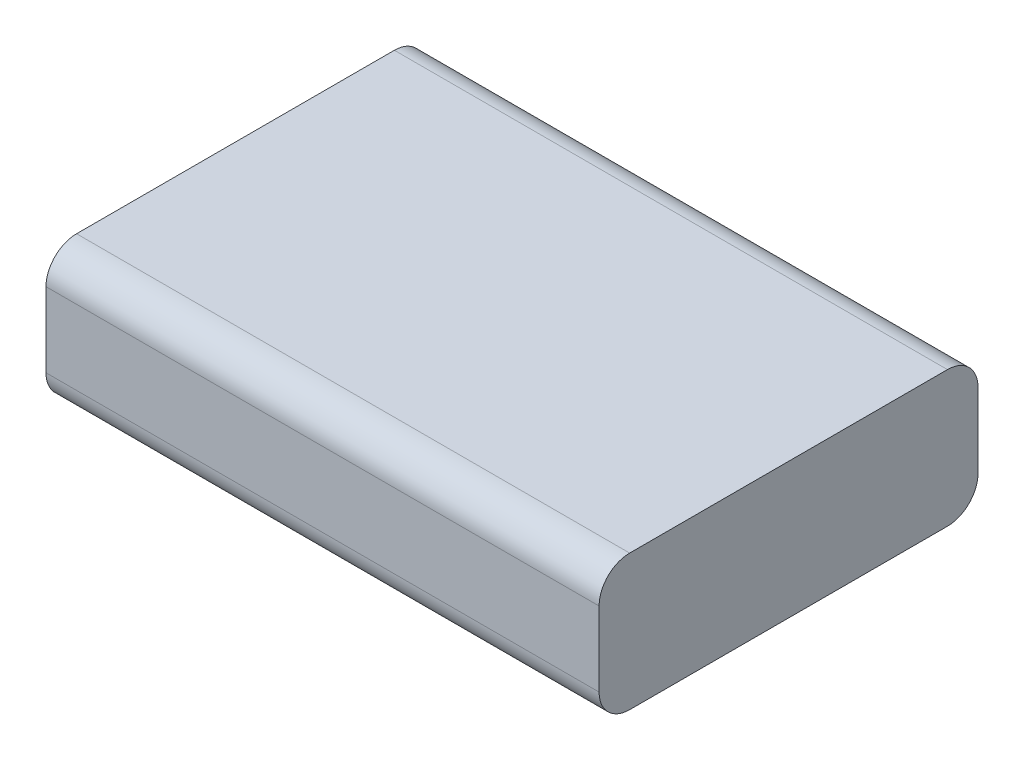
ISO-10303-21;
HEADER;
FILE_DESCRIPTION(('STEP AP214'),'2;1');
FILE_NAME('part.step','',(''),(''),'','','');
FILE_SCHEMA(('AUTOMOTIVE_DESIGN { 1 0 10303 214 1 1 1 1 }'));
ENDSEC;
DATA;
#1=APPLICATION_CONTEXT('core data for automotive mechanical design processes');
#2=APPLICATION_PROTOCOL_DEFINITION('international standard','automotive_design',2000,#1);
#3=PRODUCT_CONTEXT('',#1,'mechanical');
#4=PRODUCT('Part','Part','',(#3));
#5=PRODUCT_RELATED_PRODUCT_CATEGORY('part','',(#4));
#6=PRODUCT_DEFINITION_FORMATION('','',#4);
#7=PRODUCT_DEFINITION_CONTEXT('part definition',#1,'design');
#8=PRODUCT_DEFINITION('design','',#6,#7);
#9=PRODUCT_DEFINITION_SHAPE('','',#8);
#10=(LENGTH_UNIT() NAMED_UNIT(*) SI_UNIT(.MILLI.,.METRE.));
#11=(NAMED_UNIT(*) PLANE_ANGLE_UNIT() SI_UNIT($,.RADIAN.));
#12=(NAMED_UNIT(*) SI_UNIT($,.STERADIAN.) SOLID_ANGLE_UNIT());
#13=UNCERTAINTY_MEASURE_WITH_UNIT(LENGTH_MEASURE(1.E-05),#10,'distance_accuracy_value','');
#14=(GEOMETRIC_REPRESENTATION_CONTEXT(3) GLOBAL_UNCERTAINTY_ASSIGNED_CONTEXT((#13)) GLOBAL_UNIT_ASSIGNED_CONTEXT((#10,
#11,#12)) REPRESENTATION_CONTEXT('',''));
#15=CARTESIAN_POINT('',(0.,0.,0.));
#16=DIRECTION('',(0.,0.,1.));
#17=DIRECTION('',(1.,0.,0.));
#18=AXIS2_PLACEMENT_3D('',#15,#16,#17);
#19=CARTESIAN_POINT('',(0.,22.2,0.));
#20=DIRECTION('',(1.,0.,0.));
#21=DIRECTION('',(0.,0.,-1.));
#22=AXIS2_PLACEMENT_3D('',#19,#20,#21);
#23=PLANE('',#22);
#24=DIRECTION('',(0.,-1.,0.));
#25=VECTOR('',#24,1.);
#26=CARTESIAN_POINT('',(0.,22.2,-62.));
#27=LINE('',#26,#25);
#28=CARTESIAN_POINT('',(0.,17.2,-62.));
#29=VERTEX_POINT('',#28);
#30=CARTESIAN_POINT('',(0.,5.,-62.));
#31=VERTEX_POINT('',#30);
#32=EDGE_CURVE('E106',#29,#31,#27,.T.);
#33=ORIENTED_EDGE('',*,*,#32,.T.);
#34=CARTESIAN_POINT('',(0.,5.,-57.));
#35=DIRECTION('',(1.,0.,0.));
#36=DIRECTION('',(0.,0.,-1.));
#37=AXIS2_PLACEMENT_3D('',#34,#35,#36);
#38=CIRCLE('',#37,5.);
#39=CARTESIAN_POINT('',(0.,0.,-57.));
#40=VERTEX_POINT('',#39);
#41=EDGE_CURVE('E113',#31,#40,#38,.F.);
#42=ORIENTED_EDGE('',*,*,#41,.T.);
#43=DIRECTION('',(0.,0.,1.));
#44=VECTOR('',#43,1.);
#45=CARTESIAN_POINT('',(0.,0.,0.));
#46=LINE('',#45,#44);
#47=CARTESIAN_POINT('',(0.,0.,-5.));
#48=VERTEX_POINT('',#47);
#49=EDGE_CURVE('E173',#40,#48,#46,.T.);
#50=ORIENTED_EDGE('',*,*,#49,.T.);
#51=CARTESIAN_POINT('',(0.,5.,-5.));
#52=DIRECTION('',(1.,0.,0.));
#53=DIRECTION('',(0.,0.,-1.));
#54=AXIS2_PLACEMENT_3D('',#51,#52,#53);
#55=CIRCLE('',#54,5.);
#56=CARTESIAN_POINT('',(0.,5.,0.));
#57=VERTEX_POINT('',#56);
#58=EDGE_CURVE('E114',#48,#57,#55,.F.);
#59=ORIENTED_EDGE('',*,*,#58,.T.);
#60=DIRECTION('',(0.,-1.,0.));
#61=VECTOR('',#60,1.);
#62=CARTESIAN_POINT('',(0.,22.2,0.));
#63=LINE('',#62,#61);
#64=CARTESIAN_POINT('',(0.,17.2,0.));
#65=VERTEX_POINT('',#64);
#66=EDGE_CURVE('E130',#65,#57,#63,.T.);
#67=ORIENTED_EDGE('',*,*,#66,.F.);
#68=CARTESIAN_POINT('',(0.,17.2,-5.));
#69=DIRECTION('',(1.,0.,0.));
#70=DIRECTION('',(0.,0.,-1.));
#71=AXIS2_PLACEMENT_3D('',#68,#69,#70);
#72=CIRCLE('',#71,5.);
#73=CARTESIAN_POINT('',(0.,22.2,-5.));
#74=VERTEX_POINT('',#73);
#75=EDGE_CURVE('E132',#65,#74,#72,.F.);
#76=ORIENTED_EDGE('',*,*,#75,.T.);
#77=DIRECTION('',(0.,0.,1.));
#78=VECTOR('',#77,1.);
#79=CARTESIAN_POINT('',(0.,22.2,0.));
#80=LINE('',#79,#78);
#81=CARTESIAN_POINT('',(0.,22.2,-57.));
#82=VERTEX_POINT('',#81);
#83=EDGE_CURVE('E108',#82,#74,#80,.T.);
#84=ORIENTED_EDGE('',*,*,#83,.F.);
#85=CARTESIAN_POINT('',(0.,17.2,-57.));
#86=DIRECTION('',(1.,0.,0.));
#87=DIRECTION('',(0.,0.,-1.));
#88=AXIS2_PLACEMENT_3D('',#85,#86,#87);
#89=CIRCLE('',#88,5.);
#90=EDGE_CURVE('E104',#82,#29,#89,.F.);
#91=ORIENTED_EDGE('',*,*,#90,.T.);
#92=EDGE_LOOP('',(#33,#42,#50,#59,#67,#76,#84,#91));
#93=FACE_BOUND('',#92,.T.);
#94=ADVANCED_FACE('F38',(#93),#23,.F.);
#95=CARTESIAN_POINT('',(0.,22.2,0.));
#96=DIRECTION('',(0.,0.,-1.));
#97=DIRECTION('',(-1.,0.,0.));
#98=AXIS2_PLACEMENT_3D('',#95,#96,#97);
#99=PLANE('',#98);
#100=ORIENTED_EDGE('',*,*,#66,.T.);
#101=DIRECTION('',(1.,0.,0.));
#102=VECTOR('',#101,1.);
#103=CARTESIAN_POINT('',(90.5,5.,0.));
#104=LINE('',#103,#102);
#105=CARTESIAN_POINT('',(90.5,5.,0.));
#106=VERTEX_POINT('',#105);
#107=EDGE_CURVE('E11',#57,#106,#104,.T.);
#108=ORIENTED_EDGE('',*,*,#107,.T.);
#109=DIRECTION('',(0.,-1.,0.));
#110=VECTOR('',#109,1.);
#111=CARTESIAN_POINT('',(90.5,22.2,0.));
#112=LINE('',#111,#110);
#113=CARTESIAN_POINT('',(90.5,17.2,0.));
#114=VERTEX_POINT('',#113);
#115=EDGE_CURVE('E135',#114,#106,#112,.T.);
#116=ORIENTED_EDGE('',*,*,#115,.F.);
#117=DIRECTION('',(1.,0.,0.));
#118=VECTOR('',#117,1.);
#119=CARTESIAN_POINT('',(0.,17.2,0.));
#120=LINE('',#119,#118);
#121=EDGE_CURVE('E46',#114,#65,#120,.F.);
#122=ORIENTED_EDGE('',*,*,#121,.T.);
#123=EDGE_LOOP('',(#100,#108,#116,#122));
#124=FACE_BOUND('',#123,.T.);
#125=ADVANCED_FACE('F158',(#124),#99,.F.);
#126=CARTESIAN_POINT('',(90.5,22.2,0.));
#127=DIRECTION('',(-1.,0.,0.));
#128=DIRECTION('',(0.,0.,1.));
#129=AXIS2_PLACEMENT_3D('',#126,#127,#128);
#130=PLANE('',#129);
#131=DIRECTION('',(0.,0.,-1.));
#132=VECTOR('',#131,1.);
#133=CARTESIAN_POINT('',(90.5,0.,0.));
#134=LINE('',#133,#132);
#135=CARTESIAN_POINT('',(90.5,0.,-5.));
#136=VERTEX_POINT('',#135);
#137=CARTESIAN_POINT('',(90.5,0.,-57.));
#138=VERTEX_POINT('',#137);
#139=EDGE_CURVE('E170',#136,#138,#134,.T.);
#140=ORIENTED_EDGE('',*,*,#139,.T.);
#141=CARTESIAN_POINT('',(90.5,5.,-57.));
#142=DIRECTION('',(-1.,0.,0.));
#143=DIRECTION('',(0.,0.,1.));
#144=AXIS2_PLACEMENT_3D('',#141,#142,#143);
#145=CIRCLE('',#144,5.);
#146=CARTESIAN_POINT('',(90.5,5.,-62.));
#147=VERTEX_POINT('',#146);
#148=EDGE_CURVE('E149',#138,#147,#145,.F.);
#149=ORIENTED_EDGE('',*,*,#148,.T.);
#150=DIRECTION('',(0.,-1.,0.));
#151=VECTOR('',#150,1.);
#152=CARTESIAN_POINT('',(90.5,22.2,-62.));
#153=LINE('',#152,#151);
#154=CARTESIAN_POINT('',(90.5,17.2,-62.));
#155=VERTEX_POINT('',#154);
#156=EDGE_CURVE('E124',#155,#147,#153,.T.);
#157=ORIENTED_EDGE('',*,*,#156,.F.);
#158=CARTESIAN_POINT('',(90.5,17.2,-57.));
#159=DIRECTION('',(-1.,0.,0.));
#160=DIRECTION('',(0.,0.,1.));
#161=AXIS2_PLACEMENT_3D('',#158,#159,#160);
#162=CIRCLE('',#161,5.);
#163=CARTESIAN_POINT('',(90.5,22.2,-57.));
#164=VERTEX_POINT('',#163);
#165=EDGE_CURVE('E129',#155,#164,#162,.F.);
#166=ORIENTED_EDGE('',*,*,#165,.T.);
#167=DIRECTION('',(0.,0.,-1.));
#168=VECTOR('',#167,1.);
#169=CARTESIAN_POINT('',(90.5,22.2,0.));
#170=LINE('',#169,#168);
#171=CARTESIAN_POINT('',(90.5,22.2,-5.));
#172=VERTEX_POINT('',#171);
#173=EDGE_CURVE('E125',#172,#164,#170,.T.);
#174=ORIENTED_EDGE('',*,*,#173,.F.);
#175=CARTESIAN_POINT('',(90.5,17.2,-5.));
#176=DIRECTION('',(-1.,0.,0.));
#177=DIRECTION('',(0.,0.,1.));
#178=AXIS2_PLACEMENT_3D('',#175,#176,#177);
#179=CIRCLE('',#178,5.);
#180=EDGE_CURVE('E60',#172,#114,#179,.F.);
#181=ORIENTED_EDGE('',*,*,#180,.T.);
#182=ORIENTED_EDGE('',*,*,#115,.T.);
#183=CARTESIAN_POINT('',(90.5,5.,-5.));
#184=DIRECTION('',(-1.,0.,0.));
#185=DIRECTION('',(0.,0.,1.));
#186=AXIS2_PLACEMENT_3D('',#183,#184,#185);
#187=CIRCLE('',#186,5.);
#188=EDGE_CURVE('E53',#106,#136,#187,.F.);
#189=ORIENTED_EDGE('',*,*,#188,.T.);
#190=EDGE_LOOP('',(#140,#149,#157,#166,#174,#181,#182,#189));
#191=FACE_BOUND('',#190,.T.);
#192=ADVANCED_FACE('F168',(#191),#130,.F.);
#193=CARTESIAN_POINT('',(0.,22.2,-62.));
#194=DIRECTION('',(0.,0.,1.));
#195=DIRECTION('',(1.,0.,0.));
#196=AXIS2_PLACEMENT_3D('',#193,#194,#195);
#197=PLANE('',#196);
#198=ORIENTED_EDGE('',*,*,#156,.T.);
#199=DIRECTION('',(-1.,0.,0.));
#200=VECTOR('',#199,1.);
#201=CARTESIAN_POINT('',(0.,5.,-62.));
#202=LINE('',#201,#200);
#203=EDGE_CURVE('E123',#147,#31,#202,.T.);
#204=ORIENTED_EDGE('',*,*,#203,.T.);
#205=ORIENTED_EDGE('',*,*,#32,.F.);
#206=DIRECTION('',(-1.,0.,0.));
#207=VECTOR('',#206,1.);
#208=CARTESIAN_POINT('',(0.,17.2,-62.));
#209=LINE('',#208,#207);
#210=EDGE_CURVE('E120',#29,#155,#209,.F.);
#211=ORIENTED_EDGE('',*,*,#210,.T.);
#212=EDGE_LOOP('',(#198,#204,#205,#211));
#213=FACE_BOUND('',#212,.T.);
#214=ADVANCED_FACE('F119',(#213),#197,.F.);
#215=CARTESIAN_POINT('',(0.,22.2,0.));
#216=DIRECTION('',(0.,-1.,0.));
#217=DIRECTION('',(0.,0.,-1.));
#218=AXIS2_PLACEMENT_3D('',#215,#216,#217);
#219=PLANE('',#218);
#220=ORIENTED_EDGE('',*,*,#173,.T.);
#221=DIRECTION('',(-1.,0.,0.));
#222=VECTOR('',#221,1.);
#223=CARTESIAN_POINT('',(0.,22.2,-57.));
#224=LINE('',#223,#222);
#225=EDGE_CURVE('E154',#164,#82,#224,.T.);
#226=ORIENTED_EDGE('',*,*,#225,.T.);
#227=ORIENTED_EDGE('',*,*,#83,.T.);
#228=DIRECTION('',(1.,0.,0.));
#229=VECTOR('',#228,1.);
#230=CARTESIAN_POINT('',(0.,22.2,-5.));
#231=LINE('',#230,#229);
#232=EDGE_CURVE('E151',#74,#172,#231,.T.);
#233=ORIENTED_EDGE('',*,*,#232,.T.);
#234=EDGE_LOOP('',(#220,#226,#227,#233));
#235=FACE_BOUND('',#234,.T.);
#236=ADVANCED_FACE('F166',(#235),#219,.F.);
#237=CARTESIAN_POINT('',(0.,0.,0.));
#238=DIRECTION('',(0.,-1.,0.));
#239=DIRECTION('',(0.,0.,-1.));
#240=AXIS2_PLACEMENT_3D('',#237,#238,#239);
#241=PLANE('',#240);
#242=ORIENTED_EDGE('',*,*,#49,.F.);
#243=DIRECTION('',(-1.,0.,0.));
#244=VECTOR('',#243,1.);
#245=CARTESIAN_POINT('',(90.5,0.,-57.));
#246=LINE('',#245,#244);
#247=EDGE_CURVE('E144',#40,#138,#246,.F.);
#248=ORIENTED_EDGE('',*,*,#247,.T.);
#249=ORIENTED_EDGE('',*,*,#139,.F.);
#250=DIRECTION('',(1.,0.,0.));
#251=VECTOR('',#250,1.);
#252=CARTESIAN_POINT('',(0.,0.,-5.));
#253=LINE('',#252,#251);
#254=EDGE_CURVE('E142',#136,#48,#253,.F.);
#255=ORIENTED_EDGE('',*,*,#254,.T.);
#256=EDGE_LOOP('',(#242,#248,#249,#255));
#257=FACE_BOUND('',#256,.T.);
#258=ADVANCED_FACE('F180',(#257),#241,.T.);
#259=CARTESIAN_POINT('',(0.,5.,-57.));
#260=DIRECTION('',(1.,0.,0.));
#261=DIRECTION('',(0.,0.,-1.));
#262=AXIS2_PLACEMENT_3D('',#259,#260,#261);
#263=CYLINDRICAL_SURFACE('',#262,5.);
#264=ORIENTED_EDGE('',*,*,#148,.F.);
#265=ORIENTED_EDGE('',*,*,#247,.F.);
#266=ORIENTED_EDGE('',*,*,#41,.F.);
#267=ORIENTED_EDGE('',*,*,#203,.F.);
#268=EDGE_LOOP('',(#264,#265,#266,#267));
#269=FACE_BOUND('',#268,.T.);
#270=ADVANCED_FACE('F188',(#269),#263,.T.);
#271=CARTESIAN_POINT('',(0.,17.2,-57.));
#272=DIRECTION('',(-1.,0.,0.));
#273=DIRECTION('',(0.,0.,1.));
#274=AXIS2_PLACEMENT_3D('',#271,#272,#273);
#275=CYLINDRICAL_SURFACE('',#274,5.);
#276=ORIENTED_EDGE('',*,*,#165,.F.);
#277=ORIENTED_EDGE('',*,*,#210,.F.);
#278=ORIENTED_EDGE('',*,*,#90,.F.);
#279=ORIENTED_EDGE('',*,*,#225,.F.);
#280=EDGE_LOOP('',(#276,#277,#278,#279));
#281=FACE_BOUND('',#280,.T.);
#282=ADVANCED_FACE('F128',(#281),#275,.T.);
#283=CARTESIAN_POINT('',(0.,5.,-5.));
#284=DIRECTION('',(-1.,0.,0.));
#285=DIRECTION('',(0.,0.,1.));
#286=AXIS2_PLACEMENT_3D('',#283,#284,#285);
#287=CYLINDRICAL_SURFACE('',#286,5.);
#288=ORIENTED_EDGE('',*,*,#58,.F.);
#289=ORIENTED_EDGE('',*,*,#254,.F.);
#290=ORIENTED_EDGE('',*,*,#188,.F.);
#291=ORIENTED_EDGE('',*,*,#107,.F.);
#292=EDGE_LOOP('',(#288,#289,#290,#291));
#293=FACE_BOUND('',#292,.T.);
#294=ADVANCED_FACE('F182',(#293),#287,.T.);
#295=CARTESIAN_POINT('',(0.,17.2,-5.));
#296=DIRECTION('',(1.,0.,0.));
#297=DIRECTION('',(0.,0.,-1.));
#298=AXIS2_PLACEMENT_3D('',#295,#296,#297);
#299=CYLINDRICAL_SURFACE('',#298,5.);
#300=ORIENTED_EDGE('',*,*,#75,.F.);
#301=ORIENTED_EDGE('',*,*,#121,.F.);
#302=ORIENTED_EDGE('',*,*,#180,.F.);
#303=ORIENTED_EDGE('',*,*,#232,.F.);
#304=EDGE_LOOP('',(#300,#301,#302,#303));
#305=FACE_BOUND('',#304,.T.);
#306=ADVANCED_FACE('F40',(#305),#299,.T.);
#307=CLOSED_SHELL('',(#94,#125,#192,#214,#236,#258,#270,#282,#294,#306));
#308=MANIFOLD_SOLID_BREP('B2',#307);
#309=ADVANCED_BREP_SHAPE_REPRESENTATION('',(#18,#308),#14);
#310=SHAPE_DEFINITION_REPRESENTATION(#9,#309);
ENDSEC;
END-ISO-10303-21;
